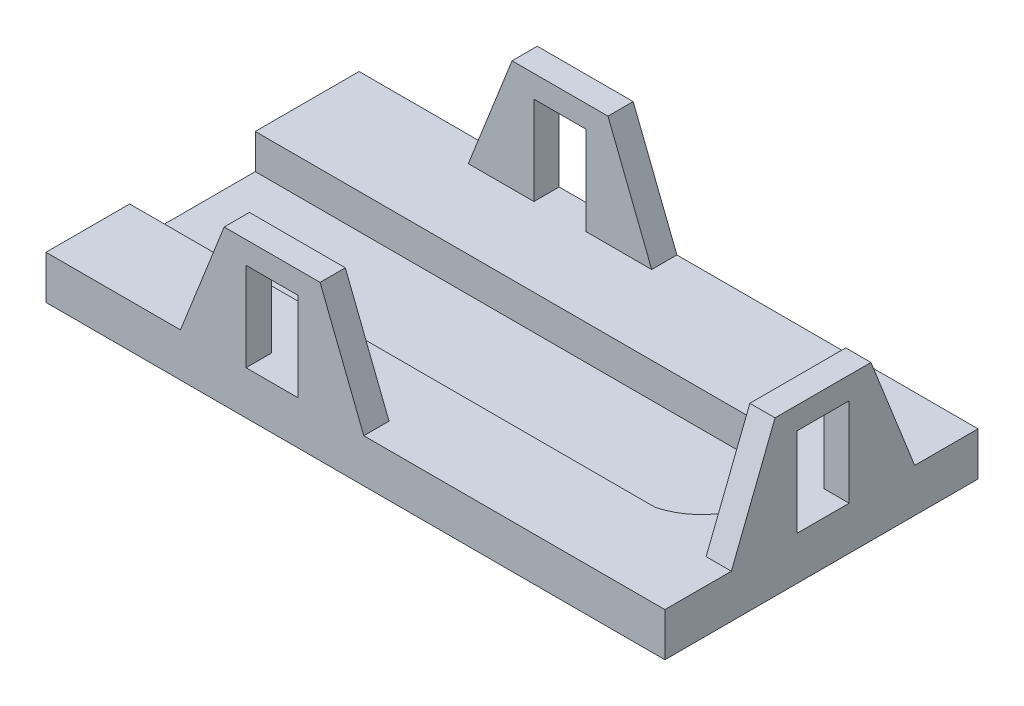
ISO-10303-21;
HEADER;
FILE_DESCRIPTION(('STEP AP214'),'2;1');
FILE_NAME('part.step','',(''),(''),'','','');
FILE_SCHEMA(('AUTOMOTIVE_DESIGN { 1 0 10303 214 1 1 1 1 }'));
ENDSEC;
DATA;
#1=APPLICATION_CONTEXT('core data for automotive mechanical design processes');
#2=APPLICATION_PROTOCOL_DEFINITION('international standard','automotive_design',2000,#1);
#3=PRODUCT_CONTEXT('',#1,'mechanical');
#4=PRODUCT('Part','Part','',(#3));
#5=PRODUCT_RELATED_PRODUCT_CATEGORY('part','',(#4));
#6=PRODUCT_DEFINITION_FORMATION('','',#4);
#7=PRODUCT_DEFINITION_CONTEXT('part definition',#1,'design');
#8=PRODUCT_DEFINITION('design','',#6,#7);
#9=PRODUCT_DEFINITION_SHAPE('','',#8);
#10=(LENGTH_UNIT() NAMED_UNIT(*) SI_UNIT(.MILLI.,.METRE.));
#11=(NAMED_UNIT(*) PLANE_ANGLE_UNIT() SI_UNIT($,.RADIAN.));
#12=(NAMED_UNIT(*) SI_UNIT($,.STERADIAN.) SOLID_ANGLE_UNIT());
#13=UNCERTAINTY_MEASURE_WITH_UNIT(LENGTH_MEASURE(1.E-05),#10,'distance_accuracy_value','');
#14=(GEOMETRIC_REPRESENTATION_CONTEXT(3) GLOBAL_UNCERTAINTY_ASSIGNED_CONTEXT((#13)) GLOBAL_UNIT_ASSIGNED_CONTEXT((#10,
#11,#12)) REPRESENTATION_CONTEXT('',''));
#15=CARTESIAN_POINT('',(0.,0.,0.));
#16=DIRECTION('',(0.,0.,1.));
#17=DIRECTION('',(1.,0.,0.));
#18=AXIS2_PLACEMENT_3D('',#15,#16,#17);
#19=CARTESIAN_POINT('',(0.,2.5,0.));
#20=DIRECTION('',(0.,-1.,0.));
#21=DIRECTION('',(0.,0.,-1.));
#22=AXIS2_PLACEMENT_3D('',#19,#20,#21);
#23=PLANE('',#22);
#24=DIRECTION('',(-1.,0.,0.));
#25=VECTOR('',#24,1.);
#26=CARTESIAN_POINT('',(35.58,2.5,-14.36));
#27=LINE('',#26,#25);
#28=CARTESIAN_POINT('',(35.58,2.5,-14.36));
#29=VERTEX_POINT('',#28);
#30=CARTESIAN_POINT('',(34.13,2.5,-14.36));
#31=VERTEX_POINT('',#30);
#32=EDGE_CURVE('E268',#29,#31,#27,.T.);
#33=ORIENTED_EDGE('',*,*,#32,.F.);
#34=DIRECTION('',(0.,0.,-1.));
#35=VECTOR('',#34,1.);
#36=CARTESIAN_POINT('',(35.58,2.5,0.));
#37=LINE('',#36,#35);
#38=CARTESIAN_POINT('',(35.58,2.5,-18.));
#39=VERTEX_POINT('',#38);
#40=EDGE_CURVE('E427',#29,#39,#37,.T.);
#41=ORIENTED_EDGE('',*,*,#40,.T.);
#42=DIRECTION('',(-1.,0.,0.));
#43=VECTOR('',#42,1.);
#44=CARTESIAN_POINT('',(0.,2.5,-18.));
#45=LINE('',#44,#43);
#46=CARTESIAN_POINT('',(18.27,2.5,-18.));
#47=VERTEX_POINT('',#46);
#48=EDGE_CURVE('E473',#39,#47,#45,.T.);
#49=ORIENTED_EDGE('',*,*,#48,.T.);
#50=DIRECTION('',(0.,0.,-1.));
#51=VECTOR('',#50,1.);
#52=CARTESIAN_POINT('',(18.27,2.5,-18.));
#53=LINE('',#52,#51);
#54=CARTESIAN_POINT('',(18.27,2.5,-16.55));
#55=VERTEX_POINT('',#54);
#56=EDGE_CURVE('E355',#55,#47,#53,.T.);
#57=ORIENTED_EDGE('',*,*,#56,.F.);
#58=DIRECTION('',(1.,0.,0.));
#59=VECTOR('',#58,1.);
#60=CARTESIAN_POINT('',(7.73,2.5,-16.55));
#61=LINE('',#60,#59);
#62=CARTESIAN_POINT('',(14.5,2.5,-16.55));
#63=VERTEX_POINT('',#62);
#64=EDGE_CURVE('E362',#63,#55,#61,.T.);
#65=ORIENTED_EDGE('',*,*,#64,.F.);
#66=DIRECTION('',(0.,0.,1.));
#67=VECTOR('',#66,1.);
#68=CARTESIAN_POINT('',(14.5,2.5,-22.93));
#69=LINE('',#68,#67);
#70=CARTESIAN_POINT('',(14.5,2.5,-18.));
#71=VERTEX_POINT('',#70);
#72=EDGE_CURVE('E335',#71,#63,#69,.T.);
#73=ORIENTED_EDGE('',*,*,#72,.F.);
#74=DIRECTION('',(1.,0.,0.));
#75=VECTOR('',#74,1.);
#76=CARTESIAN_POINT('',(0.,2.5,-18.));
#77=LINE('',#76,#75);
#78=CARTESIAN_POINT('',(11.5,2.5,-18.));
#79=VERTEX_POINT('',#78);
#80=EDGE_CURVE('E332',#79,#71,#77,.T.);
#81=ORIENTED_EDGE('',*,*,#80,.F.);
#82=DIRECTION('',(0.,0.,1.));
#83=VECTOR('',#82,1.);
#84=CARTESIAN_POINT('',(11.5,2.5,-22.93));
#85=LINE('',#84,#83);
#86=CARTESIAN_POINT('',(11.5,2.5,-16.55));
#87=VERTEX_POINT('',#86);
#88=EDGE_CURVE('E329',#79,#87,#85,.T.);
#89=ORIENTED_EDGE('',*,*,#88,.T.);
#90=CARTESIAN_POINT('',(7.73,2.5,-16.55));
#91=VERTEX_POINT('',#90);
#92=EDGE_CURVE('E359',#91,#87,#61,.T.);
#93=ORIENTED_EDGE('',*,*,#92,.F.);
#94=DIRECTION('',(0.,0.,1.));
#95=VECTOR('',#94,1.);
#96=CARTESIAN_POINT('',(7.73,2.5,-18.));
#97=LINE('',#96,#95);
#98=CARTESIAN_POINT('',(7.73,2.5,-18.));
#99=VERTEX_POINT('',#98);
#100=EDGE_CURVE('E350',#99,#91,#97,.T.);
#101=ORIENTED_EDGE('',*,*,#100,.F.);
#102=CARTESIAN_POINT('',(0.,2.5,-18.));
#103=VERTEX_POINT('',#102);
#104=EDGE_CURVE('E426',#99,#103,#45,.T.);
#105=ORIENTED_EDGE('',*,*,#104,.T.);
#106=DIRECTION('',(0.,0.,1.));
#107=VECTOR('',#106,1.);
#108=CARTESIAN_POINT('',(0.,2.5,0.));
#109=LINE('',#108,#107);
#110=CARTESIAN_POINT('',(0.,2.5,-12.03));
#111=VERTEX_POINT('',#110);
#112=EDGE_CURVE('E509',#103,#111,#109,.T.);
#113=ORIENTED_EDGE('',*,*,#112,.T.);
#114=DIRECTION('',(-1.,0.,0.));
#115=VECTOR('',#114,1.);
#116=CARTESIAN_POINT('',(0.,2.5,-12.03));
#117=LINE('',#116,#115);
#118=CARTESIAN_POINT('',(30.2036763076075,2.5,-12.03));
#119=VERTEX_POINT('',#118);
#120=EDGE_CURVE('E503',#119,#111,#117,.T.);
#121=ORIENTED_EDGE('',*,*,#120,.F.);
#122=CARTESIAN_POINT('',(29.2716179372648,2.5,-8.42));
#123=DIRECTION('',(0.,1.,0.));
#124=DIRECTION('',(0.,0.,-1.));
#125=AXIS2_PLACEMENT_3D('',#122,#123,#124);
#126=CIRCLE('',#125,3.72838206273524);
#127=CARTESIAN_POINT('',(30.2036763076075,2.5,-4.81));
#128=VERTEX_POINT('',#127);
#129=EDGE_CURVE('E655',#128,#119,#126,.T.);
#130=ORIENTED_EDGE('',*,*,#129,.F.);
#131=DIRECTION('',(1.,0.,0.));
#132=VECTOR('',#131,1.);
#133=CARTESIAN_POINT('',(0.,2.5,-4.81));
#134=LINE('',#133,#132);
#135=CARTESIAN_POINT('',(0.,2.5,-4.81));
#136=VERTEX_POINT('',#135);
#137=EDGE_CURVE('E358',#136,#128,#134,.T.);
#138=ORIENTED_EDGE('',*,*,#137,.F.);
#139=CARTESIAN_POINT('',(0.,2.5,0.));
#140=VERTEX_POINT('',#139);
#141=EDGE_CURVE('E485',#136,#140,#109,.T.);
#142=ORIENTED_EDGE('',*,*,#141,.T.);
#143=DIRECTION('',(1.,0.,0.));
#144=VECTOR('',#143,1.);
#145=CARTESIAN_POINT('',(0.,2.5,0.));
#146=LINE('',#145,#144);
#147=CARTESIAN_POINT('',(7.73,2.5,0.));
#148=VERTEX_POINT('',#147);
#149=EDGE_CURVE('E461',#140,#148,#146,.T.);
#150=ORIENTED_EDGE('',*,*,#149,.T.);
#151=DIRECTION('',(0.,0.,-1.));
#152=VECTOR('',#151,1.);
#153=CARTESIAN_POINT('',(7.73,2.5,0.));
#154=LINE('',#153,#152);
#155=CARTESIAN_POINT('',(7.73,2.5,-1.45));
#156=VERTEX_POINT('',#155);
#157=EDGE_CURVE('E305',#148,#156,#154,.T.);
#158=ORIENTED_EDGE('',*,*,#157,.T.);
#159=DIRECTION('',(1.,0.,0.));
#160=VECTOR('',#159,1.);
#161=CARTESIAN_POINT('',(7.73,2.5,-1.45));
#162=LINE('',#161,#160);
#163=CARTESIAN_POINT('',(11.5,2.5,-1.45));
#164=VERTEX_POINT('',#163);
#165=EDGE_CURVE('E310',#156,#164,#162,.T.);
#166=ORIENTED_EDGE('',*,*,#165,.T.);
#167=DIRECTION('',(0.,0.,-1.));
#168=VECTOR('',#167,1.);
#169=CARTESIAN_POINT('',(11.5,2.5,4.93));
#170=LINE('',#169,#168);
#171=CARTESIAN_POINT('',(11.5,2.5,0.));
#172=VERTEX_POINT('',#171);
#173=EDGE_CURVE('E288',#172,#164,#170,.T.);
#174=ORIENTED_EDGE('',*,*,#173,.F.);
#175=DIRECTION('',(1.,0.,0.));
#176=VECTOR('',#175,1.);
#177=CARTESIAN_POINT('',(0.,2.5,0.));
#178=LINE('',#177,#176);
#179=CARTESIAN_POINT('',(14.5,2.5,0.));
#180=VERTEX_POINT('',#179);
#181=EDGE_CURVE('E301',#172,#180,#178,.T.);
#182=ORIENTED_EDGE('',*,*,#181,.T.);
#183=DIRECTION('',(0.,0.,-1.));
#184=VECTOR('',#183,1.);
#185=CARTESIAN_POINT('',(14.5,2.5,4.93));
#186=LINE('',#185,#184);
#187=CARTESIAN_POINT('',(14.5,2.5,-1.45));
#188=VERTEX_POINT('',#187);
#189=EDGE_CURVE('E291',#180,#188,#186,.T.);
#190=ORIENTED_EDGE('',*,*,#189,.T.);
#191=CARTESIAN_POINT('',(18.27,2.5,-1.45));
#192=VERTEX_POINT('',#191);
#193=EDGE_CURVE('E319',#188,#192,#162,.T.);
#194=ORIENTED_EDGE('',*,*,#193,.T.);
#195=DIRECTION('',(0.,0.,1.));
#196=VECTOR('',#195,1.);
#197=CARTESIAN_POINT('',(18.27,2.5,0.));
#198=LINE('',#197,#196);
#199=CARTESIAN_POINT('',(18.27,2.5,0.));
#200=VERTEX_POINT('',#199);
#201=EDGE_CURVE('E316',#192,#200,#198,.T.);
#202=ORIENTED_EDGE('',*,*,#201,.T.);
#203=CARTESIAN_POINT('',(35.58,2.5,0.));
#204=VERTEX_POINT('',#203);
#205=EDGE_CURVE('E424',#200,#204,#146,.T.);
#206=ORIENTED_EDGE('',*,*,#205,.T.);
#207=CARTESIAN_POINT('',(35.58,2.5,-3.82));
#208=VERTEX_POINT('',#207);
#209=EDGE_CURVE('E419',#204,#208,#37,.T.);
#210=ORIENTED_EDGE('',*,*,#209,.T.);
#211=DIRECTION('',(1.,0.,0.));
#212=VECTOR('',#211,1.);
#213=CARTESIAN_POINT('',(35.58,2.5,-3.82));
#214=LINE('',#213,#212);
#215=CARTESIAN_POINT('',(34.13,2.5,-3.82));
#216=VERTEX_POINT('',#215);
#217=EDGE_CURVE('E265',#216,#208,#214,.T.);
#218=ORIENTED_EDGE('',*,*,#217,.F.);
#219=DIRECTION('',(0.,0.,1.));
#220=VECTOR('',#219,1.);
#221=CARTESIAN_POINT('',(34.13,2.5,-3.82));
#222=LINE('',#221,#220);
#223=CARTESIAN_POINT('',(34.13,2.5,-7.59));
#224=VERTEX_POINT('',#223);
#225=EDGE_CURVE('E257',#224,#216,#222,.T.);
#226=ORIENTED_EDGE('',*,*,#225,.F.);
#227=DIRECTION('',(-1.,0.,0.));
#228=VECTOR('',#227,1.);
#229=CARTESIAN_POINT('',(40.51,2.5,-7.59));
#230=LINE('',#229,#228);
#231=CARTESIAN_POINT('',(35.58,2.5,-7.59));
#232=VERTEX_POINT('',#231);
#233=EDGE_CURVE('E50',#232,#224,#230,.T.);
#234=ORIENTED_EDGE('',*,*,#233,.F.);
#235=DIRECTION('',(0.,0.,1.));
#236=VECTOR('',#235,1.);
#237=CARTESIAN_POINT('',(35.58,2.5,0.));
#238=LINE('',#237,#236);
#239=CARTESIAN_POINT('',(35.58,2.5,-10.59));
#240=VERTEX_POINT('',#239);
#241=EDGE_CURVE('E442',#240,#232,#238,.T.);
#242=ORIENTED_EDGE('',*,*,#241,.F.);
#243=DIRECTION('',(-1.,0.,0.));
#244=VECTOR('',#243,1.);
#245=CARTESIAN_POINT('',(40.51,2.5,-10.59));
#246=LINE('',#245,#244);
#247=CARTESIAN_POINT('',(34.13,2.5,-10.59));
#248=VERTEX_POINT('',#247);
#249=EDGE_CURVE('E252',#240,#248,#246,.T.);
#250=ORIENTED_EDGE('',*,*,#249,.T.);
#251=EDGE_CURVE('E267',#31,#248,#222,.T.);
#252=ORIENTED_EDGE('',*,*,#251,.F.);
#253=EDGE_LOOP('',(#33,#41,#49,#57,#65,#73,#81,#89,#93,#101,#105,#113,#121,#130,#138,#142,#150,
#158,#166,#174,#182,#190,#194,#202,#206,#210,#218,#226,#234,#242,#250,#252));
#254=FACE_BOUND('',#253,.T.);
#255=ADVANCED_FACE('F35',(#254),#23,.F.);
#256=CARTESIAN_POINT('',(0.,2.5,0.));
#257=DIRECTION('',(0.,0.,-1.));
#258=DIRECTION('',(-1.,0.,0.));
#259=AXIS2_PLACEMENT_3D('',#256,#257,#258);
#260=PLANE('',#259);
#261=ORIENTED_EDGE('',*,*,#205,.F.);
#262=DIRECTION('',(0.366501226724295,-0.930417567982025,0.));
#263=VECTOR('',#262,1.);
#264=CARTESIAN_POINT('',(18.27,2.49999999999996,0.));
#265=LINE('',#264,#263);
#266=CARTESIAN_POINT('',(15.7568511655767,8.88,0.));
#267=VERTEX_POINT('',#266);
#268=EDGE_CURVE('E394',#200,#267,#265,.F.);
#269=ORIENTED_EDGE('',*,*,#268,.T.);
#270=DIRECTION('',(-1.,0.,0.));
#271=VECTOR('',#270,1.);
#272=CARTESIAN_POINT('',(7.73,8.88,0.));
#273=LINE('',#272,#271);
#274=CARTESIAN_POINT('',(10.2431488344233,8.88,0.));
#275=VERTEX_POINT('',#274);
#276=EDGE_CURVE('E306',#267,#275,#273,.T.);
#277=ORIENTED_EDGE('',*,*,#276,.T.);
#278=DIRECTION('',(0.366501226724295,0.930417567982025,0.));
#279=VECTOR('',#278,1.);
#280=CARTESIAN_POINT('',(7.73,2.49999999999994,0.));
#281=LINE('',#280,#279);
#282=EDGE_CURVE('E392',#275,#148,#281,.F.);
#283=ORIENTED_EDGE('',*,*,#282,.T.);
#284=ORIENTED_EDGE('',*,*,#149,.F.);
#285=DIRECTION('',(0.,-1.,0.));
#286=VECTOR('',#285,1.);
#287=CARTESIAN_POINT('',(0.,2.5,0.));
#288=LINE('',#287,#286);
#289=CARTESIAN_POINT('',(0.,0.,0.));
#290=VERTEX_POINT('',#289);
#291=EDGE_CURVE('E377',#140,#290,#288,.T.);
#292=ORIENTED_EDGE('',*,*,#291,.T.);
#293=DIRECTION('',(1.,0.,0.));
#294=VECTOR('',#293,1.);
#295=CARTESIAN_POINT('',(0.,0.,0.));
#296=LINE('',#295,#294);
#297=CARTESIAN_POINT('',(35.58,0.,0.));
#298=VERTEX_POINT('',#297);
#299=EDGE_CURVE('E487',#290,#298,#296,.T.);
#300=ORIENTED_EDGE('',*,*,#299,.T.);
#301=DIRECTION('',(0.,-1.,0.));
#302=VECTOR('',#301,1.);
#303=CARTESIAN_POINT('',(35.58,2.5,0.));
#304=LINE('',#303,#302);
#305=EDGE_CURVE('E478',#204,#298,#304,.T.);
#306=ORIENTED_EDGE('',*,*,#305,.F.);
#307=EDGE_LOOP('',(#261,#269,#277,#283,#284,#292,#300,#306));
#308=FACE_BOUND('',#307,.T.);
#309=DIRECTION('',(0.,-1.,0.));
#310=VECTOR('',#309,1.);
#311=CARTESIAN_POINT('',(11.5,2.5,0.));
#312=LINE('',#311,#310);
#313=CARTESIAN_POINT('',(11.5,7.6,0.));
#314=VERTEX_POINT('',#313);
#315=EDGE_CURVE('E303',#314,#172,#312,.T.);
#316=ORIENTED_EDGE('',*,*,#315,.F.);
#317=DIRECTION('',(-1.,0.,0.));
#318=VECTOR('',#317,1.);
#319=CARTESIAN_POINT('',(0.,7.6,0.));
#320=LINE('',#319,#318);
#321=CARTESIAN_POINT('',(14.5,7.6,0.));
#322=VERTEX_POINT('',#321);
#323=EDGE_CURVE('E290',#322,#314,#320,.T.);
#324=ORIENTED_EDGE('',*,*,#323,.F.);
#325=DIRECTION('',(0.,1.,0.));
#326=VECTOR('',#325,1.);
#327=CARTESIAN_POINT('',(14.5,2.5,0.));
#328=LINE('',#327,#326);
#329=EDGE_CURVE('E298',#180,#322,#328,.T.);
#330=ORIENTED_EDGE('',*,*,#329,.F.);
#331=ORIENTED_EDGE('',*,*,#181,.F.);
#332=EDGE_LOOP('',(#316,#324,#330,#331));
#333=FACE_BOUND('',#332,.T.);
#334=ADVANCED_FACE('F518',(#308,#333),#260,.F.);
#335=CARTESIAN_POINT('',(7.73,8.88,-1.45));
#336=DIRECTION('',(0.,0.,-1.));
#337=DIRECTION('',(-1.,0.,0.));
#338=AXIS2_PLACEMENT_3D('',#335,#336,#337);
#339=PLANE('',#338);
#340=DIRECTION('',(-1.,0.,0.));
#341=VECTOR('',#340,1.);
#342=CARTESIAN_POINT('',(11.5,7.6,-1.45));
#343=LINE('',#342,#341);
#344=CARTESIAN_POINT('',(14.5,7.6,-1.45));
#345=VERTEX_POINT('',#344);
#346=CARTESIAN_POINT('',(11.5,7.6,-1.45));
#347=VERTEX_POINT('',#346);
#348=EDGE_CURVE('E280',#345,#347,#343,.T.);
#349=ORIENTED_EDGE('',*,*,#348,.T.);
#350=DIRECTION('',(0.,-1.,0.));
#351=VECTOR('',#350,1.);
#352=CARTESIAN_POINT('',(11.5,2.5,-1.45));
#353=LINE('',#352,#351);
#354=EDGE_CURVE('E277',#347,#164,#353,.T.);
#355=ORIENTED_EDGE('',*,*,#354,.T.);
#356=ORIENTED_EDGE('',*,*,#165,.F.);
#357=DIRECTION('',(-0.366501226724295,-0.930417567982026,0.));
#358=VECTOR('',#357,1.);
#359=CARTESIAN_POINT('',(9.90557476859938,8.02301830816516,-1.45));
#360=LINE('',#359,#358);
#361=CARTESIAN_POINT('',(10.2431488344233,8.88,-1.45));
#362=VERTEX_POINT('',#361);
#363=EDGE_CURVE('E400',#156,#362,#360,.F.);
#364=ORIENTED_EDGE('',*,*,#363,.T.);
#365=DIRECTION('',(1.,0.,0.));
#366=VECTOR('',#365,1.);
#367=CARTESIAN_POINT('',(7.73,8.88,-1.45));
#368=LINE('',#367,#366);
#369=CARTESIAN_POINT('',(15.7568511655767,8.88,-1.45));
#370=VERTEX_POINT('',#369);
#371=EDGE_CURVE('E309',#362,#370,#368,.T.);
#372=ORIENTED_EDGE('',*,*,#371,.T.);
#373=DIRECTION('',(-0.366501226724295,0.930417567982026,0.));
#374=VECTOR('',#373,1.);
#375=CARTESIAN_POINT('',(14.6786592389337,11.6171496656945,-1.45));
#376=LINE('',#375,#374);
#377=EDGE_CURVE('E402',#370,#192,#376,.F.);
#378=ORIENTED_EDGE('',*,*,#377,.T.);
#379=ORIENTED_EDGE('',*,*,#193,.F.);
#380=DIRECTION('',(0.,1.,0.));
#381=VECTOR('',#380,1.);
#382=CARTESIAN_POINT('',(14.5,2.5,-1.45));
#383=LINE('',#382,#381);
#384=EDGE_CURVE('E284',#188,#345,#383,.T.);
#385=ORIENTED_EDGE('',*,*,#384,.T.);
#386=EDGE_LOOP('',(#349,#355,#356,#364,#372,#378,#379,#385));
#387=FACE_BOUND('',#386,.T.);
#388=ADVANCED_FACE('F524',(#387),#339,.T.);
#389=CARTESIAN_POINT('',(0.,2.5,0.));
#390=DIRECTION('',(1.,0.,0.));
#391=DIRECTION('',(0.,0.,-1.));
#392=AXIS2_PLACEMENT_3D('',#389,#390,#391);
#393=PLANE('',#392);
#394=DIRECTION('',(0.,0.,1.));
#395=VECTOR('',#394,1.);
#396=CARTESIAN_POINT('',(0.,0.5,-12.03));
#397=LINE('',#396,#395);
#398=CARTESIAN_POINT('',(0.,0.5,-12.03));
#399=VERTEX_POINT('',#398);
#400=CARTESIAN_POINT('',(0.,0.5,-4.81));
#401=VERTEX_POINT('',#400);
#402=EDGE_CURVE('E365',#399,#401,#397,.T.);
#403=ORIENTED_EDGE('',*,*,#402,.F.);
#404=DIRECTION('',(0.,1.,0.));
#405=VECTOR('',#404,1.);
#406=CARTESIAN_POINT('',(0.,0.5,-12.03));
#407=LINE('',#406,#405);
#408=EDGE_CURVE('E490',#399,#111,#407,.T.);
#409=ORIENTED_EDGE('',*,*,#408,.T.);
#410=ORIENTED_EDGE('',*,*,#112,.F.);
#411=DIRECTION('',(0.,-1.,0.));
#412=VECTOR('',#411,1.);
#413=CARTESIAN_POINT('',(0.,2.5,-18.));
#414=LINE('',#413,#412);
#415=CARTESIAN_POINT('',(0.,0.,-18.));
#416=VERTEX_POINT('',#415);
#417=EDGE_CURVE('E475',#103,#416,#414,.T.);
#418=ORIENTED_EDGE('',*,*,#417,.T.);
#419=DIRECTION('',(0.,0.,1.));
#420=VECTOR('',#419,1.);
#421=CARTESIAN_POINT('',(0.,0.,0.));
#422=LINE('',#421,#420);
#423=EDGE_CURVE('E468',#416,#290,#422,.T.);
#424=ORIENTED_EDGE('',*,*,#423,.T.);
#425=ORIENTED_EDGE('',*,*,#291,.F.);
#426=ORIENTED_EDGE('',*,*,#141,.F.);
#427=DIRECTION('',(0.,1.,0.));
#428=VECTOR('',#427,1.);
#429=CARTESIAN_POINT('',(0.,0.5,-4.81));
#430=LINE('',#429,#428);
#431=EDGE_CURVE('E507',#401,#136,#430,.T.);
#432=ORIENTED_EDGE('',*,*,#431,.F.);
#433=EDGE_LOOP('',(#403,#409,#410,#418,#424,#425,#426,#432));
#434=FACE_BOUND('',#433,.T.);
#435=ADVANCED_FACE('F521',(#434),#393,.F.);
#436=CARTESIAN_POINT('',(35.58,2.5,0.));
#437=DIRECTION('',(-1.,0.,0.));
#438=DIRECTION('',(0.,0.,1.));
#439=AXIS2_PLACEMENT_3D('',#436,#437,#438);
#440=PLANE('',#439);
#441=DIRECTION('',(0.,0.,-1.));
#442=VECTOR('',#441,1.);
#443=CARTESIAN_POINT('',(35.58,7.6,0.));
#444=LINE('',#443,#442);
#445=CARTESIAN_POINT('',(35.58,7.6,-7.59));
#446=VERTEX_POINT('',#445);
#447=CARTESIAN_POINT('',(35.58,7.6,-10.59));
#448=VERTEX_POINT('',#447);
#449=EDGE_CURVE('E438',#446,#448,#444,.T.);
#450=ORIENTED_EDGE('',*,*,#449,.T.);
#451=DIRECTION('',(0.,-1.,0.));
#452=VECTOR('',#451,1.);
#453=CARTESIAN_POINT('',(35.58,2.5,-10.59));
#454=LINE('',#453,#452);
#455=EDGE_CURVE('E271',#448,#240,#454,.T.);
#456=ORIENTED_EDGE('',*,*,#455,.T.);
#457=ORIENTED_EDGE('',*,*,#241,.T.);
#458=DIRECTION('',(0.,1.,0.));
#459=VECTOR('',#458,1.);
#460=CARTESIAN_POINT('',(35.58,2.5,-7.59));
#461=LINE('',#460,#459);
#462=EDGE_CURVE('E249',#232,#446,#461,.T.);
#463=ORIENTED_EDGE('',*,*,#462,.T.);
#464=EDGE_LOOP('',(#450,#456,#457,#463));
#465=FACE_BOUND('',#464,.T.);
#466=ORIENTED_EDGE('',*,*,#40,.F.);
#467=DIRECTION('',(0.,0.930417567982026,0.366501226724294));
#468=VECTOR('',#467,1.);
#469=CARTESIAN_POINT('',(35.58,8.87999999999999,-11.8468511655767));
#470=LINE('',#469,#468);
#471=CARTESIAN_POINT('',(35.58,8.88,-11.8468511655767));
#472=VERTEX_POINT('',#471);
#473=EDGE_CURVE('E11',#29,#472,#470,.T.);
#474=ORIENTED_EDGE('',*,*,#473,.T.);
#475=DIRECTION('',(0.,0.,-1.));
#476=VECTOR('',#475,1.);
#477=CARTESIAN_POINT('',(35.58,8.88,-3.82));
#478=LINE('',#477,#476);
#479=CARTESIAN_POINT('',(35.58,8.88,-6.33314883442333));
#480=VERTEX_POINT('',#479);
#481=EDGE_CURVE('E276',#480,#472,#478,.T.);
#482=ORIENTED_EDGE('',*,*,#481,.F.);
#483=DIRECTION('',(0.,-0.930417567982026,0.366501226724295));
#484=VECTOR('',#483,1.);
#485=CARTESIAN_POINT('',(35.58,8.88,-6.33314883442333));
#486=LINE('',#485,#484);
#487=EDGE_CURVE('E43',#480,#208,#486,.T.);
#488=ORIENTED_EDGE('',*,*,#487,.T.);
#489=ORIENTED_EDGE('',*,*,#209,.F.);
#490=ORIENTED_EDGE('',*,*,#305,.T.);
#491=DIRECTION('',(0.,0.,-1.));
#492=VECTOR('',#491,1.);
#493=CARTESIAN_POINT('',(35.58,0.,0.));
#494=LINE('',#493,#492);
#495=CARTESIAN_POINT('',(35.58,0.,-18.));
#496=VERTEX_POINT('',#495);
#497=EDGE_CURVE('E486',#298,#496,#494,.T.);
#498=ORIENTED_EDGE('',*,*,#497,.T.);
#499=DIRECTION('',(0.,-1.,0.));
#500=VECTOR('',#499,1.);
#501=CARTESIAN_POINT('',(35.58,2.5,-18.));
#502=LINE('',#501,#500);
#503=EDGE_CURVE('E458',#39,#496,#502,.T.);
#504=ORIENTED_EDGE('',*,*,#503,.F.);
#505=EDGE_LOOP('',(#466,#474,#482,#488,#489,#490,#498,#504));
#506=FACE_BOUND('',#505,.T.);
#507=ADVANCED_FACE('F417',(#465,#506),#440,.F.);
#508=CARTESIAN_POINT('',(0.,2.5,-18.));
#509=DIRECTION('',(0.,0.,1.));
#510=DIRECTION('',(1.,0.,0.));
#511=AXIS2_PLACEMENT_3D('',#508,#509,#510);
#512=PLANE('',#511);
#513=DIRECTION('',(-1.,0.,0.));
#514=VECTOR('',#513,1.);
#515=CARTESIAN_POINT('',(0.,7.6,-18.));
#516=LINE('',#515,#514);
#517=CARTESIAN_POINT('',(14.5,7.6,-18.));
#518=VERTEX_POINT('',#517);
#519=CARTESIAN_POINT('',(11.5,7.6,-18.));
#520=VERTEX_POINT('',#519);
#521=EDGE_CURVE('E344',#518,#520,#516,.T.);
#522=ORIENTED_EDGE('',*,*,#521,.T.);
#523=DIRECTION('',(0.,-1.,0.));
#524=VECTOR('',#523,1.);
#525=CARTESIAN_POINT('',(11.5,2.5,-18.));
#526=LINE('',#525,#524);
#527=EDGE_CURVE('E347',#520,#79,#526,.T.);
#528=ORIENTED_EDGE('',*,*,#527,.T.);
#529=ORIENTED_EDGE('',*,*,#80,.T.);
#530=DIRECTION('',(0.,1.,0.));
#531=VECTOR('',#530,1.);
#532=CARTESIAN_POINT('',(14.5,2.5,-18.));
#533=LINE('',#532,#531);
#534=EDGE_CURVE('E341',#71,#518,#533,.T.);
#535=ORIENTED_EDGE('',*,*,#534,.T.);
#536=EDGE_LOOP('',(#522,#528,#529,#535));
#537=FACE_BOUND('',#536,.T.);
#538=DIRECTION('',(-1.,0.,0.));
#539=VECTOR('',#538,1.);
#540=CARTESIAN_POINT('',(7.73,8.88,-18.));
#541=LINE('',#540,#539);
#542=CARTESIAN_POINT('',(15.7568511655767,8.88,-18.));
#543=VERTEX_POINT('',#542);
#544=CARTESIAN_POINT('',(10.2431488344233,8.88,-18.));
#545=VERTEX_POINT('',#544);
#546=EDGE_CURVE('E354',#543,#545,#541,.T.);
#547=ORIENTED_EDGE('',*,*,#546,.F.);
#548=DIRECTION('',(0.366501226724295,-0.930417567982025,0.));
#549=VECTOR('',#548,1.);
#550=CARTESIAN_POINT('',(15.7568511655767,8.87999999999997,-18.));
#551=LINE('',#550,#549);
#552=EDGE_CURVE('E382',#543,#47,#551,.T.);
#553=ORIENTED_EDGE('',*,*,#552,.T.);
#554=ORIENTED_EDGE('',*,*,#48,.F.);
#555=ORIENTED_EDGE('',*,*,#503,.T.);
#556=DIRECTION('',(-1.,0.,0.));
#557=VECTOR('',#556,1.);
#558=CARTESIAN_POINT('',(0.,0.,-18.));
#559=LINE('',#558,#557);
#560=EDGE_CURVE('E483',#496,#416,#559,.T.);
#561=ORIENTED_EDGE('',*,*,#560,.T.);
#562=ORIENTED_EDGE('',*,*,#417,.F.);
#563=ORIENTED_EDGE('',*,*,#104,.F.);
#564=DIRECTION('',(0.366501226724295,0.930417567982025,0.));
#565=VECTOR('',#564,1.);
#566=CARTESIAN_POINT('',(10.2431488344233,8.88,-18.));
#567=LINE('',#566,#565);
#568=EDGE_CURVE('E380',#99,#545,#567,.T.);
#569=ORIENTED_EDGE('',*,*,#568,.T.);
#570=EDGE_LOOP('',(#547,#553,#554,#555,#561,#562,#563,#569));
#571=FACE_BOUND('',#570,.T.);
#572=ADVANCED_FACE('F530',(#537,#571),#512,.F.);
#573=CARTESIAN_POINT('',(0.,0.,0.));
#574=DIRECTION('',(0.,-1.,0.));
#575=DIRECTION('',(0.,0.,-1.));
#576=AXIS2_PLACEMENT_3D('',#573,#574,#575);
#577=PLANE('',#576);
#578=ORIENTED_EDGE('',*,*,#423,.F.);
#579=ORIENTED_EDGE('',*,*,#560,.F.);
#580=ORIENTED_EDGE('',*,*,#497,.F.);
#581=ORIENTED_EDGE('',*,*,#299,.F.);
#582=EDGE_LOOP('',(#578,#579,#580,#581));
#583=FACE_BOUND('',#582,.T.);
#584=ADVANCED_FACE('F546',(#583),#577,.T.);
#585=CARTESIAN_POINT('',(0.,0.5,-12.03));
#586=DIRECTION('',(0.,0.,-1.));
#587=DIRECTION('',(-1.,0.,0.));
#588=AXIS2_PLACEMENT_3D('',#585,#586,#587);
#589=PLANE('',#588);
#590=ORIENTED_EDGE('',*,*,#120,.T.);
#591=ORIENTED_EDGE('',*,*,#408,.F.);
#592=DIRECTION('',(-1.,0.,0.));
#593=VECTOR('',#592,1.);
#594=CARTESIAN_POINT('',(0.,0.5,-12.03));
#595=LINE('',#594,#593);
#596=CARTESIAN_POINT('',(30.2036763076075,0.5,-12.03));
#597=VERTEX_POINT('',#596);
#598=EDGE_CURVE('E508',#597,#399,#595,.T.);
#599=ORIENTED_EDGE('',*,*,#598,.F.);
#600=DIRECTION('',(0.,1.,0.));
#601=VECTOR('',#600,1.);
#602=CARTESIAN_POINT('',(30.2036763076075,0.5,-12.03));
#603=LINE('',#602,#601);
#604=EDGE_CURVE('E495',#597,#119,#603,.T.);
#605=ORIENTED_EDGE('',*,*,#604,.T.);
#606=EDGE_LOOP('',(#590,#591,#599,#605));
#607=FACE_BOUND('',#606,.T.);
#608=ADVANCED_FACE('F549',(#607),#589,.F.);
#609=CARTESIAN_POINT('',(29.2716179372648,0.5,-8.42));
#610=DIRECTION('',(0.,1.,0.));
#611=DIRECTION('',(0.,0.,1.));
#612=AXIS2_PLACEMENT_3D('',#609,#610,#611);
#613=CYLINDRICAL_SURFACE('',#612,3.72838206273524);
#614=ORIENTED_EDGE('',*,*,#129,.T.);
#615=ORIENTED_EDGE('',*,*,#604,.F.);
#616=CARTESIAN_POINT('',(29.2716179372648,0.5,-8.42));
#617=DIRECTION('',(0.,1.,0.));
#618=DIRECTION('',(0.,0.,-1.));
#619=AXIS2_PLACEMENT_3D('',#616,#617,#618);
#620=CIRCLE('',#619,3.72838206273524);
#621=CARTESIAN_POINT('',(30.2036763076075,0.5,-4.81));
#622=VERTEX_POINT('',#621);
#623=EDGE_CURVE('E661',#622,#597,#620,.T.);
#624=ORIENTED_EDGE('',*,*,#623,.F.);
#625=DIRECTION('',(0.,1.,0.));
#626=VECTOR('',#625,1.);
#627=CARTESIAN_POINT('',(30.2036763076075,0.5,-4.81));
#628=LINE('',#627,#626);
#629=EDGE_CURVE('E500',#622,#128,#628,.T.);
#630=ORIENTED_EDGE('',*,*,#629,.T.);
#631=EDGE_LOOP('',(#614,#615,#624,#630));
#632=FACE_BOUND('',#631,.T.);
#633=ADVANCED_FACE('F646',(#632),#613,.F.);
#634=CARTESIAN_POINT('',(0.,0.5,-4.81));
#635=DIRECTION('',(0.,0.,1.));
#636=DIRECTION('',(1.,0.,0.));
#637=AXIS2_PLACEMENT_3D('',#634,#635,#636);
#638=PLANE('',#637);
#639=ORIENTED_EDGE('',*,*,#137,.T.);
#640=ORIENTED_EDGE('',*,*,#629,.F.);
#641=DIRECTION('',(1.,0.,0.));
#642=VECTOR('',#641,1.);
#643=CARTESIAN_POINT('',(0.,0.5,-4.81));
#644=LINE('',#643,#642);
#645=EDGE_CURVE('E658',#401,#622,#644,.T.);
#646=ORIENTED_EDGE('',*,*,#645,.F.);
#647=ORIENTED_EDGE('',*,*,#431,.T.);
#648=EDGE_LOOP('',(#639,#640,#646,#647));
#649=FACE_BOUND('',#648,.T.);
#650=ADVANCED_FACE('F544',(#649),#638,.F.);
#651=CARTESIAN_POINT('',(29.2716179372648,0.5,-8.42));
#652=DIRECTION('',(0.,-1.,0.));
#653=DIRECTION('',(0.,0.,-1.));
#654=AXIS2_PLACEMENT_3D('',#651,#652,#653);
#655=PLANE('',#654);
#656=ORIENTED_EDGE('',*,*,#402,.T.);
#657=ORIENTED_EDGE('',*,*,#645,.T.);
#658=ORIENTED_EDGE('',*,*,#623,.T.);
#659=ORIENTED_EDGE('',*,*,#598,.T.);
#660=EDGE_LOOP('',(#656,#657,#658,#659));
#661=FACE_BOUND('',#660,.T.);
#662=ADVANCED_FACE('F641',(#661),#655,.F.);
#663=CARTESIAN_POINT('',(7.73,8.88,-16.55));
#664=DIRECTION('',(0.,0.,-1.));
#665=DIRECTION('',(-1.,0.,0.));
#666=AXIS2_PLACEMENT_3D('',#663,#664,#665);
#667=PLANE('',#666);
#668=ORIENTED_EDGE('',*,*,#92,.T.);
#669=DIRECTION('',(0.,-1.,0.));
#670=VECTOR('',#669,1.);
#671=CARTESIAN_POINT('',(11.5,2.5,-16.55));
#672=LINE('',#671,#670);
#673=CARTESIAN_POINT('',(11.5,7.6,-16.55));
#674=VERTEX_POINT('',#673);
#675=EDGE_CURVE('E313',#674,#87,#672,.T.);
#676=ORIENTED_EDGE('',*,*,#675,.F.);
#677=DIRECTION('',(-1.,0.,0.));
#678=VECTOR('',#677,1.);
#679=CARTESIAN_POINT('',(11.5,7.6,-16.55));
#680=LINE('',#679,#678);
#681=CARTESIAN_POINT('',(14.5,7.6,-16.55));
#682=VERTEX_POINT('',#681);
#683=EDGE_CURVE('E326',#682,#674,#680,.T.);
#684=ORIENTED_EDGE('',*,*,#683,.F.);
#685=DIRECTION('',(0.,1.,0.));
#686=VECTOR('',#685,1.);
#687=CARTESIAN_POINT('',(14.5,2.5,-16.55));
#688=LINE('',#687,#686);
#689=EDGE_CURVE('E323',#63,#682,#688,.T.);
#690=ORIENTED_EDGE('',*,*,#689,.F.);
#691=ORIENTED_EDGE('',*,*,#64,.T.);
#692=DIRECTION('',(-0.366501226724295,0.930417567982026,0.));
#693=VECTOR('',#692,1.);
#694=CARTESIAN_POINT('',(15.7568511655767,8.87999999999998,-16.55));
#695=LINE('',#694,#693);
#696=CARTESIAN_POINT('',(15.7568511655767,8.88,-16.55));
#697=VERTEX_POINT('',#696);
#698=EDGE_CURVE('E390',#55,#697,#695,.T.);
#699=ORIENTED_EDGE('',*,*,#698,.T.);
#700=DIRECTION('',(1.,0.,0.));
#701=VECTOR('',#700,1.);
#702=CARTESIAN_POINT('',(7.73,8.88,-16.55));
#703=LINE('',#702,#701);
#704=CARTESIAN_POINT('',(10.2431488344233,8.88,-16.55));
#705=VERTEX_POINT('',#704);
#706=EDGE_CURVE('E351',#705,#697,#703,.T.);
#707=ORIENTED_EDGE('',*,*,#706,.F.);
#708=DIRECTION('',(-0.366501226724295,-0.930417567982026,0.));
#709=VECTOR('',#708,1.);
#710=CARTESIAN_POINT('',(10.2431488344233,8.88,-16.55));
#711=LINE('',#710,#709);
#712=EDGE_CURVE('E386',#705,#91,#711,.T.);
#713=ORIENTED_EDGE('',*,*,#712,.T.);
#714=EDGE_LOOP('',(#668,#676,#684,#690,#691,#699,#707,#713));
#715=FACE_BOUND('',#714,.T.);
#716=ADVANCED_FACE('F569',(#715),#667,.F.);
#717=CARTESIAN_POINT('',(0.,8.88,0.));
#718=DIRECTION('',(0.,1.,0.));
#719=DIRECTION('',(0.,0.,1.));
#720=AXIS2_PLACEMENT_3D('',#717,#718,#719);
#721=PLANE('',#720);
#722=ORIENTED_EDGE('',*,*,#706,.T.);
#723=DIRECTION('',(0.,0.,-1.));
#724=VECTOR('',#723,1.);
#725=CARTESIAN_POINT('',(15.7568511655767,8.88,-18.));
#726=LINE('',#725,#724);
#727=EDGE_CURVE('E376',#697,#543,#726,.T.);
#728=ORIENTED_EDGE('',*,*,#727,.T.);
#729=ORIENTED_EDGE('',*,*,#546,.T.);
#730=DIRECTION('',(0.,0.,1.));
#731=VECTOR('',#730,1.);
#732=CARTESIAN_POINT('',(10.2431488344233,8.88,-16.55));
#733=LINE('',#732,#731);
#734=EDGE_CURVE('E373',#545,#705,#733,.T.);
#735=ORIENTED_EDGE('',*,*,#734,.T.);
#736=EDGE_LOOP('',(#722,#728,#729,#735));
#737=FACE_BOUND('',#736,.T.);
#738=ADVANCED_FACE('F561',(#737),#721,.T.);
#739=CARTESIAN_POINT('',(15.7568511655767,8.88,0.));
#740=DIRECTION('',(0.930417567982025,0.366501226724295,0.));
#741=DIRECTION('',(0.,0.,1.));
#742=AXIS2_PLACEMENT_3D('',#739,#740,#741);
#743=PLANE('',#742);
#744=ORIENTED_EDGE('',*,*,#698,.F.);
#745=ORIENTED_EDGE('',*,*,#56,.T.);
#746=ORIENTED_EDGE('',*,*,#552,.F.);
#747=ORIENTED_EDGE('',*,*,#727,.F.);
#748=EDGE_LOOP('',(#744,#745,#746,#747));
#749=FACE_BOUND('',#748,.T.);
#750=ADVANCED_FACE('F587',(#749),#743,.T.);
#751=CARTESIAN_POINT('',(10.2431488344233,8.88,0.));
#752=DIRECTION('',(-0.930417567982025,0.366501226724295,0.));
#753=DIRECTION('',(0.,0.,-1.));
#754=AXIS2_PLACEMENT_3D('',#751,#752,#753);
#755=PLANE('',#754);
#756=ORIENTED_EDGE('',*,*,#568,.F.);
#757=ORIENTED_EDGE('',*,*,#100,.T.);
#758=ORIENTED_EDGE('',*,*,#712,.F.);
#759=ORIENTED_EDGE('',*,*,#734,.F.);
#760=EDGE_LOOP('',(#756,#757,#758,#759));
#761=FACE_BOUND('',#760,.T.);
#762=ADVANCED_FACE('F565',(#761),#755,.T.);
#763=CARTESIAN_POINT('',(11.5,2.5,-22.93));
#764=DIRECTION('',(-1.,0.,0.));
#765=DIRECTION('',(0.,0.,1.));
#766=AXIS2_PLACEMENT_3D('',#763,#764,#765);
#767=PLANE('',#766);
#768=DIRECTION('',(0.,0.,1.));
#769=VECTOR('',#768,1.);
#770=CARTESIAN_POINT('',(11.5,7.6,-22.93));
#771=LINE('',#770,#769);
#772=EDGE_CURVE('E330',#520,#674,#771,.T.);
#773=ORIENTED_EDGE('',*,*,#772,.T.);
#774=ORIENTED_EDGE('',*,*,#675,.T.);
#775=ORIENTED_EDGE('',*,*,#88,.F.);
#776=ORIENTED_EDGE('',*,*,#527,.F.);
#777=EDGE_LOOP('',(#773,#774,#775,#776));
#778=FACE_BOUND('',#777,.T.);
#779=ADVANCED_FACE('F573',(#778),#767,.F.);
#780=CARTESIAN_POINT('',(11.5,7.6,-22.93));
#781=DIRECTION('',(0.,1.,0.));
#782=DIRECTION('',(0.,0.,1.));
#783=AXIS2_PLACEMENT_3D('',#780,#781,#782);
#784=PLANE('',#783);
#785=DIRECTION('',(0.,0.,1.));
#786=VECTOR('',#785,1.);
#787=CARTESIAN_POINT('',(14.5,7.6,-22.93));
#788=LINE('',#787,#786);
#789=EDGE_CURVE('E333',#518,#682,#788,.T.);
#790=ORIENTED_EDGE('',*,*,#789,.T.);
#791=ORIENTED_EDGE('',*,*,#683,.T.);
#792=ORIENTED_EDGE('',*,*,#772,.F.);
#793=ORIENTED_EDGE('',*,*,#521,.F.);
#794=EDGE_LOOP('',(#790,#791,#792,#793));
#795=FACE_BOUND('',#794,.T.);
#796=ADVANCED_FACE('F582',(#795),#784,.F.);
#797=CARTESIAN_POINT('',(14.5,2.5,-22.93));
#798=DIRECTION('',(1.,0.,0.));
#799=DIRECTION('',(0.,0.,-1.));
#800=AXIS2_PLACEMENT_3D('',#797,#798,#799);
#801=PLANE('',#800);
#802=ORIENTED_EDGE('',*,*,#72,.T.);
#803=ORIENTED_EDGE('',*,*,#689,.T.);
#804=ORIENTED_EDGE('',*,*,#789,.F.);
#805=ORIENTED_EDGE('',*,*,#534,.F.);
#806=EDGE_LOOP('',(#802,#803,#804,#805));
#807=FACE_BOUND('',#806,.T.);
#808=ADVANCED_FACE('F578',(#807),#801,.F.);
#809=CARTESIAN_POINT('',(0.,8.88,-18.));
#810=DIRECTION('',(0.,1.,0.));
#811=DIRECTION('',(0.,0.,-1.));
#812=AXIS2_PLACEMENT_3D('',#809,#810,#811);
#813=PLANE('',#812);
#814=ORIENTED_EDGE('',*,*,#276,.F.);
#815=DIRECTION('',(0.,0.,-1.));
#816=VECTOR('',#815,1.);
#817=CARTESIAN_POINT('',(15.7568511655767,8.88,-17.9999999999999));
#818=LINE('',#817,#816);
#819=EDGE_CURVE('E398',#267,#370,#818,.T.);
#820=ORIENTED_EDGE('',*,*,#819,.T.);
#821=ORIENTED_EDGE('',*,*,#371,.F.);
#822=DIRECTION('',(0.,0.,1.));
#823=VECTOR('',#822,1.);
#824=CARTESIAN_POINT('',(10.2431488344233,8.88,-18.));
#825=LINE('',#824,#823);
#826=EDGE_CURVE('E396',#362,#275,#825,.T.);
#827=ORIENTED_EDGE('',*,*,#826,.T.);
#828=EDGE_LOOP('',(#814,#820,#821,#827));
#829=FACE_BOUND('',#828,.T.);
#830=ADVANCED_FACE('F600',(#829),#813,.T.);
#831=CARTESIAN_POINT('',(18.27,2.49999999999996,0.));
#832=DIRECTION('',(-0.930417567982025,-0.366501226724295,0.));
#833=DIRECTION('',(0.,0.,1.));
#834=AXIS2_PLACEMENT_3D('',#831,#832,#833);
#835=PLANE('',#834);
#836=ORIENTED_EDGE('',*,*,#377,.F.);
#837=ORIENTED_EDGE('',*,*,#819,.F.);
#838=ORIENTED_EDGE('',*,*,#268,.F.);
#839=ORIENTED_EDGE('',*,*,#201,.F.);
#840=EDGE_LOOP('',(#836,#837,#838,#839));
#841=FACE_BOUND('',#840,.T.);
#842=ADVANCED_FACE('F596',(#841),#835,.F.);
#843=CARTESIAN_POINT('',(7.73,2.49999999999994,0.));
#844=DIRECTION('',(0.930417567982025,-0.366501226724295,0.));
#845=DIRECTION('',(0.,0.,-1.));
#846=AXIS2_PLACEMENT_3D('',#843,#844,#845);
#847=PLANE('',#846);
#848=ORIENTED_EDGE('',*,*,#282,.F.);
#849=ORIENTED_EDGE('',*,*,#826,.F.);
#850=ORIENTED_EDGE('',*,*,#363,.F.);
#851=ORIENTED_EDGE('',*,*,#157,.F.);
#852=EDGE_LOOP('',(#848,#849,#850,#851));
#853=FACE_BOUND('',#852,.T.);
#854=ADVANCED_FACE('F599',(#853),#847,.F.);
#855=CARTESIAN_POINT('',(11.5,2.5,4.93));
#856=DIRECTION('',(1.,0.,0.));
#857=DIRECTION('',(0.,0.,-1.));
#858=AXIS2_PLACEMENT_3D('',#855,#856,#857);
#859=PLANE('',#858);
#860=ORIENTED_EDGE('',*,*,#315,.T.);
#861=ORIENTED_EDGE('',*,*,#173,.T.);
#862=ORIENTED_EDGE('',*,*,#354,.F.);
#863=DIRECTION('',(0.,0.,-1.));
#864=VECTOR('',#863,1.);
#865=CARTESIAN_POINT('',(11.5,7.6,4.93));
#866=LINE('',#865,#864);
#867=EDGE_CURVE('E287',#314,#347,#866,.T.);
#868=ORIENTED_EDGE('',*,*,#867,.F.);
#869=EDGE_LOOP('',(#860,#861,#862,#868));
#870=FACE_BOUND('',#869,.T.);
#871=ADVANCED_FACE('F603',(#870),#859,.T.);
#872=CARTESIAN_POINT('',(14.5,2.5,4.93));
#873=DIRECTION('',(-1.,0.,0.));
#874=DIRECTION('',(0.,0.,1.));
#875=AXIS2_PLACEMENT_3D('',#872,#873,#874);
#876=PLANE('',#875);
#877=ORIENTED_EDGE('',*,*,#329,.T.);
#878=DIRECTION('',(0.,0.,-1.));
#879=VECTOR('',#878,1.);
#880=CARTESIAN_POINT('',(14.5,7.6,4.93));
#881=LINE('',#880,#879);
#882=EDGE_CURVE('E293',#322,#345,#881,.T.);
#883=ORIENTED_EDGE('',*,*,#882,.T.);
#884=ORIENTED_EDGE('',*,*,#384,.F.);
#885=ORIENTED_EDGE('',*,*,#189,.F.);
#886=EDGE_LOOP('',(#877,#883,#884,#885));
#887=FACE_BOUND('',#886,.T.);
#888=ADVANCED_FACE('F620',(#887),#876,.T.);
#889=CARTESIAN_POINT('',(11.5,7.6,4.93));
#890=DIRECTION('',(0.,-1.,0.));
#891=DIRECTION('',(0.,0.,-1.));
#892=AXIS2_PLACEMENT_3D('',#889,#890,#891);
#893=PLANE('',#892);
#894=ORIENTED_EDGE('',*,*,#323,.T.);
#895=ORIENTED_EDGE('',*,*,#867,.T.);
#896=ORIENTED_EDGE('',*,*,#348,.F.);
#897=ORIENTED_EDGE('',*,*,#882,.F.);
#898=EDGE_LOOP('',(#894,#895,#896,#897));
#899=FACE_BOUND('',#898,.T.);
#900=ADVANCED_FACE('F615',(#899),#893,.T.);
#901=CARTESIAN_POINT('',(34.13,8.88,-3.82));
#902=DIRECTION('',(1.,0.,0.));
#903=DIRECTION('',(0.,0.,-1.));
#904=AXIS2_PLACEMENT_3D('',#901,#902,#903);
#905=PLANE('',#904);
#906=ORIENTED_EDGE('',*,*,#251,.T.);
#907=DIRECTION('',(0.,-1.,0.));
#908=VECTOR('',#907,1.);
#909=CARTESIAN_POINT('',(34.13,2.5,-10.59));
#910=LINE('',#909,#908);
#911=CARTESIAN_POINT('',(34.13,7.6,-10.59));
#912=VERTEX_POINT('',#911);
#913=EDGE_CURVE('E58',#912,#248,#910,.T.);
#914=ORIENTED_EDGE('',*,*,#913,.F.);
#915=DIRECTION('',(0.,0.,-1.));
#916=VECTOR('',#915,1.);
#917=CARTESIAN_POINT('',(34.13,7.6,-10.59));
#918=LINE('',#917,#916);
#919=CARTESIAN_POINT('',(34.13,7.6,-7.59));
#920=VERTEX_POINT('',#919);
#921=EDGE_CURVE('E260',#920,#912,#918,.T.);
#922=ORIENTED_EDGE('',*,*,#921,.F.);
#923=DIRECTION('',(0.,1.,0.));
#924=VECTOR('',#923,1.);
#925=CARTESIAN_POINT('',(34.13,2.5,-7.59));
#926=LINE('',#925,#924);
#927=EDGE_CURVE('E246',#224,#920,#926,.T.);
#928=ORIENTED_EDGE('',*,*,#927,.F.);
#929=ORIENTED_EDGE('',*,*,#225,.T.);
#930=DIRECTION('',(0.,0.930417567982025,-0.366501226724295));
#931=VECTOR('',#930,1.);
#932=CARTESIAN_POINT('',(34.13,8.88,-6.33314883442333));
#933=LINE('',#932,#931);
#934=CARTESIAN_POINT('',(34.13,8.88,-6.33314883442333));
#935=VERTEX_POINT('',#934);
#936=EDGE_CURVE('E411',#216,#935,#933,.T.);
#937=ORIENTED_EDGE('',*,*,#936,.T.);
#938=DIRECTION('',(0.,0.,1.));
#939=VECTOR('',#938,1.);
#940=CARTESIAN_POINT('',(34.13,8.88,-3.82));
#941=LINE('',#940,#939);
#942=CARTESIAN_POINT('',(34.13,8.88,-11.8468511655767));
#943=VERTEX_POINT('',#942);
#944=EDGE_CURVE('E281',#943,#935,#941,.T.);
#945=ORIENTED_EDGE('',*,*,#944,.F.);
#946=DIRECTION('',(0.,-0.930417567982026,-0.366501226724294));
#947=VECTOR('',#946,1.);
#948=CARTESIAN_POINT('',(34.13,8.87999999999999,-11.8468511655767));
#949=LINE('',#948,#947);
#950=EDGE_CURVE('E413',#943,#31,#949,.T.);
#951=ORIENTED_EDGE('',*,*,#950,.T.);
#952=EDGE_LOOP('',(#906,#914,#922,#928,#929,#937,#945,#951));
#953=FACE_BOUND('',#952,.T.);
#954=ADVANCED_FACE('F256',(#953),#905,.F.);
#955=CARTESIAN_POINT('',(0.,8.88,0.));
#956=DIRECTION('',(0.,1.,0.));
#957=DIRECTION('',(0.,0.,1.));
#958=AXIS2_PLACEMENT_3D('',#955,#956,#957);
#959=PLANE('',#958);
#960=ORIENTED_EDGE('',*,*,#481,.T.);
#961=DIRECTION('',(-1.,0.,0.));
#962=VECTOR('',#961,1.);
#963=CARTESIAN_POINT('',(34.13,8.88,-11.8468511655767));
#964=LINE('',#963,#962);
#965=EDGE_CURVE('E408',#472,#943,#964,.T.);
#966=ORIENTED_EDGE('',*,*,#965,.T.);
#967=ORIENTED_EDGE('',*,*,#944,.T.);
#968=DIRECTION('',(1.,0.,0.));
#969=VECTOR('',#968,1.);
#970=CARTESIAN_POINT('',(35.58,8.88,-6.33314883442333));
#971=LINE('',#970,#969);
#972=EDGE_CURVE('E405',#935,#480,#971,.T.);
#973=ORIENTED_EDGE('',*,*,#972,.T.);
#974=EDGE_LOOP('',(#960,#966,#967,#973));
#975=FACE_BOUND('',#974,.T.);
#976=ADVANCED_FACE('F432',(#975),#959,.T.);
#977=CARTESIAN_POINT('',(0.,8.88,-11.8468511655767));
#978=DIRECTION('',(0.,0.366501226724294,-0.930417567982026));
#979=DIRECTION('',(1.,0.,0.));
#980=AXIS2_PLACEMENT_3D('',#977,#978,#979);
#981=PLANE('',#980);
#982=ORIENTED_EDGE('',*,*,#473,.F.);
#983=ORIENTED_EDGE('',*,*,#32,.T.);
#984=ORIENTED_EDGE('',*,*,#950,.F.);
#985=ORIENTED_EDGE('',*,*,#965,.F.);
#986=EDGE_LOOP('',(#982,#983,#984,#985));
#987=FACE_BOUND('',#986,.T.);
#988=ADVANCED_FACE('F455',(#987),#981,.T.);
#989=CARTESIAN_POINT('',(0.,8.88,-6.33314883442333));
#990=DIRECTION('',(0.,0.366501226724295,0.930417567982025));
#991=DIRECTION('',(-1.,0.,0.));
#992=AXIS2_PLACEMENT_3D('',#989,#990,#991);
#993=PLANE('',#992);
#994=ORIENTED_EDGE('',*,*,#936,.F.);
#995=ORIENTED_EDGE('',*,*,#217,.T.);
#996=ORIENTED_EDGE('',*,*,#487,.F.);
#997=ORIENTED_EDGE('',*,*,#972,.F.);
#998=EDGE_LOOP('',(#994,#995,#996,#997));
#999=FACE_BOUND('',#998,.T.);
#1000=ADVANCED_FACE('F37',(#999),#993,.T.);
#1001=CARTESIAN_POINT('',(40.51,2.5,-10.59));
#1002=DIRECTION('',(0.,0.,-1.));
#1003=DIRECTION('',(-1.,0.,0.));
#1004=AXIS2_PLACEMENT_3D('',#1001,#1002,#1003);
#1005=PLANE('',#1004);
#1006=DIRECTION('',(-1.,0.,0.));
#1007=VECTOR('',#1006,1.);
#1008=CARTESIAN_POINT('',(40.51,7.6,-10.59));
#1009=LINE('',#1008,#1007);
#1010=EDGE_CURVE('E444',#448,#912,#1009,.T.);
#1011=ORIENTED_EDGE('',*,*,#1010,.T.);
#1012=ORIENTED_EDGE('',*,*,#913,.T.);
#1013=ORIENTED_EDGE('',*,*,#249,.F.);
#1014=ORIENTED_EDGE('',*,*,#455,.F.);
#1015=EDGE_LOOP('',(#1011,#1012,#1013,#1014));
#1016=FACE_BOUND('',#1015,.T.);
#1017=ADVANCED_FACE('F610',(#1016),#1005,.F.);
#1018=CARTESIAN_POINT('',(40.51,7.6,-10.59));
#1019=DIRECTION('',(0.,1.,0.));
#1020=DIRECTION('',(0.,0.,1.));
#1021=AXIS2_PLACEMENT_3D('',#1018,#1019,#1020);
#1022=PLANE('',#1021);
#1023=DIRECTION('',(-1.,0.,0.));
#1024=VECTOR('',#1023,1.);
#1025=CARTESIAN_POINT('',(40.51,7.6,-7.59));
#1026=LINE('',#1025,#1024);
#1027=EDGE_CURVE('E251',#446,#920,#1026,.T.);
#1028=ORIENTED_EDGE('',*,*,#1027,.T.);
#1029=ORIENTED_EDGE('',*,*,#921,.T.);
#1030=ORIENTED_EDGE('',*,*,#1010,.F.);
#1031=ORIENTED_EDGE('',*,*,#449,.F.);
#1032=EDGE_LOOP('',(#1028,#1029,#1030,#1031));
#1033=FACE_BOUND('',#1032,.T.);
#1034=ADVANCED_FACE('F451',(#1033),#1022,.F.);
#1035=CARTESIAN_POINT('',(40.51,2.5,-7.59));
#1036=DIRECTION('',(0.,0.,1.));
#1037=DIRECTION('',(1.,0.,0.));
#1038=AXIS2_PLACEMENT_3D('',#1035,#1036,#1037);
#1039=PLANE('',#1038);
#1040=ORIENTED_EDGE('',*,*,#233,.T.);
#1041=ORIENTED_EDGE('',*,*,#927,.T.);
#1042=ORIENTED_EDGE('',*,*,#1027,.F.);
#1043=ORIENTED_EDGE('',*,*,#462,.F.);
#1044=EDGE_LOOP('',(#1040,#1041,#1042,#1043));
#1045=FACE_BOUND('',#1044,.T.);
#1046=ADVANCED_FACE('F244',(#1045),#1039,.F.);
#1047=CLOSED_SHELL('',(#255,#334,#388,#435,#507,#572,#584,#608,#633,#650,#662,#716,#738,#750,
#762,#779,#796,#808,#830,#842,#854,#871,#888,#900,#954,#976,#988,#1000,#1017,#1034,#1046));
#1048=MANIFOLD_SOLID_BREP('B2',#1047);
#1049=ADVANCED_BREP_SHAPE_REPRESENTATION('',(#18,#1048),#14);
#1050=SHAPE_DEFINITION_REPRESENTATION(#9,#1049);
ENDSEC;
END-ISO-10303-21;
